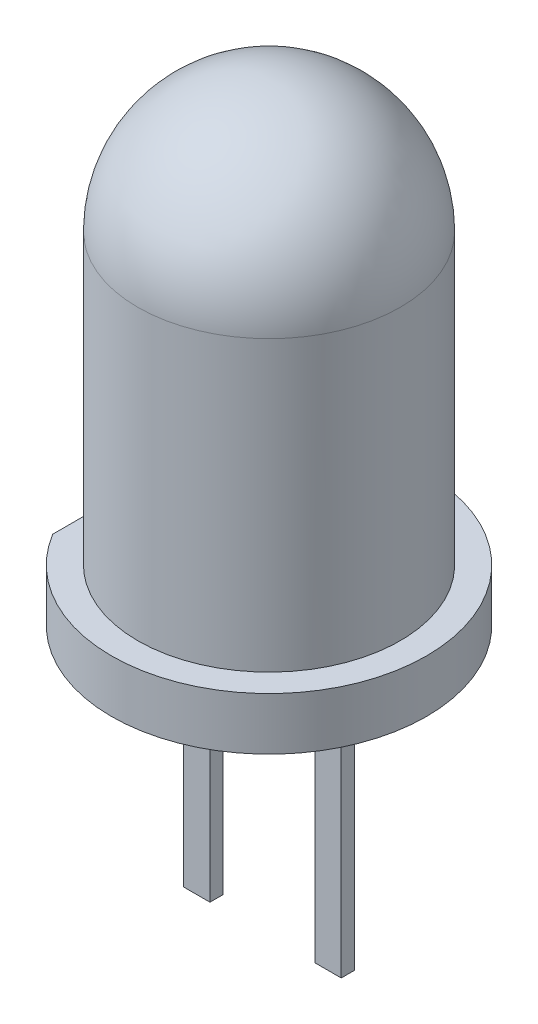
ISO-10303-21;
HEADER;
FILE_DESCRIPTION(('STEP AP214'),'2;1');
FILE_NAME('part.step','',(''),(''),'','','');
FILE_SCHEMA(('AUTOMOTIVE_DESIGN { 1 0 10303 214 1 1 1 1 }'));
ENDSEC;
DATA;
#1=APPLICATION_CONTEXT('core data for automotive mechanical design processes');
#2=APPLICATION_PROTOCOL_DEFINITION('international standard','automotive_design',2000,#1);
#3=PRODUCT_CONTEXT('',#1,'mechanical');
#4=PRODUCT('Part','Part','',(#3));
#5=PRODUCT_RELATED_PRODUCT_CATEGORY('part','',(#4));
#6=PRODUCT_DEFINITION_FORMATION('','',#4);
#7=PRODUCT_DEFINITION_CONTEXT('part definition',#1,'design');
#8=PRODUCT_DEFINITION('design','',#6,#7);
#9=PRODUCT_DEFINITION_SHAPE('','',#8);
#10=(LENGTH_UNIT() NAMED_UNIT(*) SI_UNIT(.MILLI.,.METRE.));
#11=(NAMED_UNIT(*) PLANE_ANGLE_UNIT() SI_UNIT($,.RADIAN.));
#12=(NAMED_UNIT(*) SI_UNIT($,.STERADIAN.) SOLID_ANGLE_UNIT());
#13=UNCERTAINTY_MEASURE_WITH_UNIT(LENGTH_MEASURE(1.E-05),#10,'distance_accuracy_value','');
#14=(GEOMETRIC_REPRESENTATION_CONTEXT(3) GLOBAL_UNCERTAINTY_ASSIGNED_CONTEXT((#13)) GLOBAL_UNIT_ASSIGNED_CONTEXT((#10,
#11,#12)) REPRESENTATION_CONTEXT('',''));
#15=CARTESIAN_POINT('',(0.,0.,0.));
#16=DIRECTION('',(0.,0.,1.));
#17=DIRECTION('',(1.,0.,0.));
#18=AXIS2_PLACEMENT_3D('',#15,#16,#17);
#19=CARTESIAN_POINT('',(0.,-6.5,0.));
#20=DIRECTION('',(0.,1.,0.));
#21=DIRECTION('',(0.,0.,1.));
#22=AXIS2_PLACEMENT_3D('',#19,#20,#21);
#23=PLANE('',#22);
#24=DIRECTION('',(0.,0.,-1.));
#25=VECTOR('',#24,1.);
#26=CARTESIAN_POINT('',(1.,-6.5,0.125));
#27=LINE('',#26,#25);
#28=CARTESIAN_POINT('',(1.,-6.5,0.125));
#29=VERTEX_POINT('',#28);
#30=CARTESIAN_POINT('',(1.,-6.5,-0.125));
#31=VERTEX_POINT('',#30);
#32=EDGE_CURVE('E131',#29,#31,#27,.T.);
#33=ORIENTED_EDGE('',*,*,#32,.F.);
#34=DIRECTION('',(-1.,0.,0.));
#35=VECTOR('',#34,1.);
#36=CARTESIAN_POINT('',(1.,-6.5,0.125));
#37=LINE('',#36,#35);
#38=CARTESIAN_POINT('',(1.5,-6.5,0.125));
#39=VERTEX_POINT('',#38);
#40=EDGE_CURVE('E144',#39,#29,#37,.T.);
#41=ORIENTED_EDGE('',*,*,#40,.F.);
#42=DIRECTION('',(0.,0.,1.));
#43=VECTOR('',#42,1.);
#44=CARTESIAN_POINT('',(1.5,-6.5,0.125));
#45=LINE('',#44,#43);
#46=CARTESIAN_POINT('',(1.5,-6.5,-0.125));
#47=VERTEX_POINT('',#46);
#48=EDGE_CURVE('E153',#47,#39,#45,.T.);
#49=ORIENTED_EDGE('',*,*,#48,.F.);
#50=DIRECTION('',(1.,0.,0.));
#51=VECTOR('',#50,1.);
#52=CARTESIAN_POINT('',(1.,-6.5,-0.125));
#53=LINE('',#52,#51);
#54=EDGE_CURVE('E134',#31,#47,#53,.T.);
#55=ORIENTED_EDGE('',*,*,#54,.F.);
#56=EDGE_LOOP('',(#33,#41,#49,#55));
#57=FACE_BOUND('',#56,.T.);
#58=CARTESIAN_POINT('',(0.,-6.5,0.));
#59=DIRECTION('',(0.,1.,0.));
#60=DIRECTION('',(0.,0.,1.));
#61=AXIS2_PLACEMENT_3D('',#58,#59,#60);
#62=CIRCLE('',#61,3.);
#63=CARTESIAN_POINT('',(-2.56751766388456,-6.5,1.55172582811551));
#64=VERTEX_POINT('',#63);
#65=CARTESIAN_POINT('',(-2.56751766388456,-6.5,-1.55172582811551));
#66=VERTEX_POINT('',#65);
#67=EDGE_CURVE('E41',#64,#66,#62,.T.);
#68=ORIENTED_EDGE('',*,*,#67,.F.);
#69=DIRECTION('',(0.,0.,1.));
#70=VECTOR('',#69,1.);
#71=CARTESIAN_POINT('',(-2.56751766388456,-6.5,1.75));
#72=LINE('',#71,#70);
#73=EDGE_CURVE('E169',#66,#64,#72,.T.);
#74=ORIENTED_EDGE('',*,*,#73,.F.);
#75=EDGE_LOOP('',(#68,#74));
#76=FACE_BOUND('',#75,.T.);
#77=DIRECTION('',(-1.,0.,0.));
#78=VECTOR('',#77,1.);
#79=CARTESIAN_POINT('',(-1.,-6.5,0.125));
#80=LINE('',#79,#78);
#81=CARTESIAN_POINT('',(-1.,-6.5,0.125));
#82=VERTEX_POINT('',#81);
#83=CARTESIAN_POINT('',(-1.5,-6.5,0.125));
#84=VERTEX_POINT('',#83);
#85=EDGE_CURVE('E130',#82,#84,#80,.T.);
#86=ORIENTED_EDGE('',*,*,#85,.F.);
#87=DIRECTION('',(0.,0.,1.));
#88=VECTOR('',#87,1.);
#89=CARTESIAN_POINT('',(-1.,-6.5,0.125));
#90=LINE('',#89,#88);
#91=CARTESIAN_POINT('',(-1.,-6.5,-0.125));
#92=VERTEX_POINT('',#91);
#93=EDGE_CURVE('E127',#92,#82,#90,.T.);
#94=ORIENTED_EDGE('',*,*,#93,.F.);
#95=DIRECTION('',(1.,0.,0.));
#96=VECTOR('',#95,1.);
#97=CARTESIAN_POINT('',(-1.,-6.5,-0.125));
#98=LINE('',#97,#96);
#99=CARTESIAN_POINT('',(-1.5,-6.5,-0.125));
#100=VERTEX_POINT('',#99);
#101=EDGE_CURVE('E53',#100,#92,#98,.T.);
#102=ORIENTED_EDGE('',*,*,#101,.F.);
#103=DIRECTION('',(0.,0.,-1.));
#104=VECTOR('',#103,1.);
#105=CARTESIAN_POINT('',(-1.5,-6.5,0.125));
#106=LINE('',#105,#104);
#107=EDGE_CURVE('E48',#84,#100,#106,.T.);
#108=ORIENTED_EDGE('',*,*,#107,.F.);
#109=EDGE_LOOP('',(#86,#94,#102,#108));
#110=FACE_BOUND('',#109,.T.);
#111=ADVANCED_FACE('F33',(#57,#76,#110),#23,.F.);
#112=CARTESIAN_POINT('',(0.,0.,0.));
#113=DIRECTION('',(0.,1.,0.));
#114=DIRECTION('',(1.,0.,0.));
#115=AXIS2_PLACEMENT_3D('',#112,#113,#114);
#116=SPHERICAL_SURFACE('',#115,2.5);
#117=CARTESIAN_POINT('',(0.,0.,0.));
#118=DIRECTION('',(0.,1.,0.));
#119=DIRECTION('',(0.,0.,1.));
#120=AXIS2_PLACEMENT_3D('',#117,#118,#119);
#121=CIRCLE('',#120,2.5);
#122=CARTESIAN_POINT('',(0.,0.,2.5));
#123=VERTEX_POINT('',#122);
#124=EDGE_CURVE('E177',#123,#123,#121,.T.);
#125=ORIENTED_EDGE('',*,*,#124,.T.);
#126=EDGE_LOOP('',(#125));
#127=FACE_BOUND('',#126,.T.);
#128=ADVANCED_FACE('F35',(#127),#116,.T.);
#129=CARTESIAN_POINT('',(0.,40.48125,0.));
#130=DIRECTION('',(0.,1.,0.));
#131=DIRECTION('',(0.,0.,1.));
#132=AXIS2_PLACEMENT_3D('',#129,#130,#131);
#133=CYLINDRICAL_SURFACE('',#132,3.);
#134=ORIENTED_EDGE('',*,*,#67,.T.);
#135=DIRECTION('',(0.,1.,0.));
#136=VECTOR('',#135,1.);
#137=CARTESIAN_POINT('',(-2.56751766388456,40.48125,-1.55172582811551));
#138=LINE('',#137,#136);
#139=CARTESIAN_POINT('',(-2.56751766388456,-5.5,-1.55172582811551));
#140=VERTEX_POINT('',#139);
#141=EDGE_CURVE('E174',#66,#140,#138,.T.);
#142=ORIENTED_EDGE('',*,*,#141,.T.);
#143=CARTESIAN_POINT('',(0.,-5.5,0.));
#144=DIRECTION('',(0.,1.,0.));
#145=DIRECTION('',(0.,0.,1.));
#146=AXIS2_PLACEMENT_3D('',#143,#144,#145);
#147=CIRCLE('',#146,3.);
#148=CARTESIAN_POINT('',(-2.56751766388456,-5.5,1.55172582811551));
#149=VERTEX_POINT('',#148);
#150=EDGE_CURVE('E183',#149,#140,#147,.T.);
#151=ORIENTED_EDGE('',*,*,#150,.F.);
#152=DIRECTION('',(0.,1.,0.));
#153=VECTOR('',#152,1.);
#154=CARTESIAN_POINT('',(-2.56751766388456,40.48125,1.55172582811551));
#155=LINE('',#154,#153);
#156=EDGE_CURVE('E171',#149,#64,#155,.F.);
#157=ORIENTED_EDGE('',*,*,#156,.T.);
#158=EDGE_LOOP('',(#134,#142,#151,#157));
#159=FACE_BOUND('',#158,.T.);
#160=ADVANCED_FACE('F188',(#159),#133,.T.);
#161=CARTESIAN_POINT('',(2.5,-5.5,0.));
#162=DIRECTION('',(0.,-1.,0.));
#163=DIRECTION('',(0.,0.,-1.));
#164=AXIS2_PLACEMENT_3D('',#161,#162,#163);
#165=PLANE('',#164);
#166=CARTESIAN_POINT('',(0.,-5.5,0.));
#167=DIRECTION('',(0.,1.,0.));
#168=DIRECTION('',(0.,0.,1.));
#169=AXIS2_PLACEMENT_3D('',#166,#167,#168);
#170=CIRCLE('',#169,2.5);
#171=CARTESIAN_POINT('',(0.,-5.5,2.5));
#172=VERTEX_POINT('',#171);
#173=EDGE_CURVE('E180',#172,#172,#170,.T.);
#174=ORIENTED_EDGE('',*,*,#173,.F.);
#175=EDGE_LOOP('',(#174));
#176=FACE_BOUND('',#175,.T.);
#177=ORIENTED_EDGE('',*,*,#150,.T.);
#178=DIRECTION('',(0.,0.,1.));
#179=VECTOR('',#178,1.);
#180=CARTESIAN_POINT('',(-2.56751766388456,-5.5,0.));
#181=LINE('',#180,#179);
#182=EDGE_CURVE('E11',#140,#149,#181,.T.);
#183=ORIENTED_EDGE('',*,*,#182,.T.);
#184=EDGE_LOOP('',(#177,#183));
#185=FACE_BOUND('',#184,.T.);
#186=ADVANCED_FACE('F195',(#176,#185),#165,.F.);
#187=CARTESIAN_POINT('',(0.,40.48125,0.));
#188=DIRECTION('',(0.,1.,0.));
#189=DIRECTION('',(0.,0.,1.));
#190=AXIS2_PLACEMENT_3D('',#187,#188,#189);
#191=CYLINDRICAL_SURFACE('',#190,2.5);
#192=ORIENTED_EDGE('',*,*,#124,.F.);
#193=EDGE_LOOP('',(#192));
#194=FACE_BOUND('',#193,.T.);
#195=ORIENTED_EDGE('',*,*,#173,.T.);
#196=EDGE_LOOP('',(#195));
#197=FACE_BOUND('',#196,.T.);
#198=ADVANCED_FACE('F197',(#194,#197),#191,.T.);
#199=CARTESIAN_POINT('',(-2.56751766388456,-4.5,1.75));
#200=DIRECTION('',(1.,0.,0.));
#201=DIRECTION('',(0.,0.,-1.));
#202=AXIS2_PLACEMENT_3D('',#199,#200,#201);
#203=PLANE('',#202);
#204=ORIENTED_EDGE('',*,*,#73,.T.);
#205=ORIENTED_EDGE('',*,*,#156,.F.);
#206=ORIENTED_EDGE('',*,*,#182,.F.);
#207=ORIENTED_EDGE('',*,*,#141,.F.);
#208=EDGE_LOOP('',(#204,#205,#206,#207));
#209=FACE_BOUND('',#208,.T.);
#210=ADVANCED_FACE('F193',(#209),#203,.F.);
#211=CARTESIAN_POINT('',(1.,-11.5,0.125));
#212=DIRECTION('',(1.,0.,0.));
#213=DIRECTION('',(0.,0.,-1.));
#214=AXIS2_PLACEMENT_3D('',#211,#212,#213);
#215=PLANE('',#214);
#216=ORIENTED_EDGE('',*,*,#32,.T.);
#217=DIRECTION('',(0.,1.,0.));
#218=VECTOR('',#217,1.);
#219=CARTESIAN_POINT('',(1.,-11.5,-0.125));
#220=LINE('',#219,#218);
#221=CARTESIAN_POINT('',(1.,-11.5,-0.125));
#222=VERTEX_POINT('',#221);
#223=EDGE_CURVE('E166',#222,#31,#220,.T.);
#224=ORIENTED_EDGE('',*,*,#223,.F.);
#225=DIRECTION('',(0.,0.,-1.));
#226=VECTOR('',#225,1.);
#227=CARTESIAN_POINT('',(1.,-11.5,0.125));
#228=LINE('',#227,#226);
#229=CARTESIAN_POINT('',(1.,-11.5,0.125));
#230=VERTEX_POINT('',#229);
#231=EDGE_CURVE('E140',#230,#222,#228,.T.);
#232=ORIENTED_EDGE('',*,*,#231,.F.);
#233=DIRECTION('',(0.,1.,0.));
#234=VECTOR('',#233,1.);
#235=CARTESIAN_POINT('',(1.,-11.5,0.125));
#236=LINE('',#235,#234);
#237=EDGE_CURVE('E149',#230,#29,#236,.T.);
#238=ORIENTED_EDGE('',*,*,#237,.T.);
#239=EDGE_LOOP('',(#216,#224,#232,#238));
#240=FACE_BOUND('',#239,.T.);
#241=ADVANCED_FACE('F222',(#240),#215,.F.);
#242=CARTESIAN_POINT('',(1.,-11.5,-0.125));
#243=DIRECTION('',(0.,0.,1.));
#244=DIRECTION('',(1.,0.,0.));
#245=AXIS2_PLACEMENT_3D('',#242,#243,#244);
#246=PLANE('',#245);
#247=ORIENTED_EDGE('',*,*,#54,.T.);
#248=DIRECTION('',(0.,1.,0.));
#249=VECTOR('',#248,1.);
#250=CARTESIAN_POINT('',(1.5,-11.5,-0.125));
#251=LINE('',#250,#249);
#252=CARTESIAN_POINT('',(1.5,-11.5,-0.125));
#253=VERTEX_POINT('',#252);
#254=EDGE_CURVE('E163',#253,#47,#251,.T.);
#255=ORIENTED_EDGE('',*,*,#254,.F.);
#256=DIRECTION('',(1.,0.,0.));
#257=VECTOR('',#256,1.);
#258=CARTESIAN_POINT('',(1.,-11.5,-0.125));
#259=LINE('',#258,#257);
#260=EDGE_CURVE('E143',#222,#253,#259,.T.);
#261=ORIENTED_EDGE('',*,*,#260,.F.);
#262=ORIENTED_EDGE('',*,*,#223,.T.);
#263=EDGE_LOOP('',(#247,#255,#261,#262));
#264=FACE_BOUND('',#263,.T.);
#265=ADVANCED_FACE('F230',(#264),#246,.F.);
#266=CARTESIAN_POINT('',(1.5,-11.5,0.125));
#267=DIRECTION('',(-1.,0.,0.));
#268=DIRECTION('',(0.,0.,1.));
#269=AXIS2_PLACEMENT_3D('',#266,#267,#268);
#270=PLANE('',#269);
#271=ORIENTED_EDGE('',*,*,#48,.T.);
#272=DIRECTION('',(0.,1.,0.));
#273=VECTOR('',#272,1.);
#274=CARTESIAN_POINT('',(1.5,-11.5,0.125));
#275=LINE('',#274,#273);
#276=CARTESIAN_POINT('',(1.5,-11.5,0.125));
#277=VERTEX_POINT('',#276);
#278=EDGE_CURVE('E160',#277,#39,#275,.T.);
#279=ORIENTED_EDGE('',*,*,#278,.F.);
#280=DIRECTION('',(0.,0.,1.));
#281=VECTOR('',#280,1.);
#282=CARTESIAN_POINT('',(1.5,-11.5,0.125));
#283=LINE('',#282,#281);
#284=EDGE_CURVE('E146',#253,#277,#283,.T.);
#285=ORIENTED_EDGE('',*,*,#284,.F.);
#286=ORIENTED_EDGE('',*,*,#254,.T.);
#287=EDGE_LOOP('',(#271,#279,#285,#286));
#288=FACE_BOUND('',#287,.T.);
#289=ADVANCED_FACE('F228',(#288),#270,.F.);
#290=CARTESIAN_POINT('',(1.,-11.5,0.125));
#291=DIRECTION('',(0.,0.,-1.));
#292=DIRECTION('',(-1.,0.,0.));
#293=AXIS2_PLACEMENT_3D('',#290,#291,#292);
#294=PLANE('',#293);
#295=ORIENTED_EDGE('',*,*,#40,.T.);
#296=ORIENTED_EDGE('',*,*,#237,.F.);
#297=DIRECTION('',(-1.,0.,0.));
#298=VECTOR('',#297,1.);
#299=CARTESIAN_POINT('',(1.,-11.5,0.125));
#300=LINE('',#299,#298);
#301=EDGE_CURVE('E148',#277,#230,#300,.T.);
#302=ORIENTED_EDGE('',*,*,#301,.F.);
#303=ORIENTED_EDGE('',*,*,#278,.T.);
#304=EDGE_LOOP('',(#295,#296,#302,#303));
#305=FACE_BOUND('',#304,.T.);
#306=ADVANCED_FACE('F218',(#305),#294,.F.);
#307=CARTESIAN_POINT('',(0.,-11.5,0.));
#308=DIRECTION('',(0.,-1.,0.));
#309=DIRECTION('',(0.,0.,-1.));
#310=AXIS2_PLACEMENT_3D('',#307,#308,#309);
#311=PLANE('',#310);
#312=ORIENTED_EDGE('',*,*,#231,.T.);
#313=ORIENTED_EDGE('',*,*,#260,.T.);
#314=ORIENTED_EDGE('',*,*,#284,.T.);
#315=ORIENTED_EDGE('',*,*,#301,.T.);
#316=EDGE_LOOP('',(#312,#313,#314,#315));
#317=FACE_BOUND('',#316,.T.);
#318=ADVANCED_FACE('F224',(#317),#311,.T.);
#319=CARTESIAN_POINT('',(-1.,-11.5,0.125));
#320=DIRECTION('',(0.,0.,-1.));
#321=DIRECTION('',(-1.,0.,0.));
#322=AXIS2_PLACEMENT_3D('',#319,#320,#321);
#323=PLANE('',#322);
#324=ORIENTED_EDGE('',*,*,#85,.T.);
#325=DIRECTION('',(0.,1.,0.));
#326=VECTOR('',#325,1.);
#327=CARTESIAN_POINT('',(-1.5,-11.5,0.125));
#328=LINE('',#327,#326);
#329=CARTESIAN_POINT('',(-1.5,-11.5,0.125));
#330=VERTEX_POINT('',#329);
#331=EDGE_CURVE('E111',#330,#84,#328,.T.);
#332=ORIENTED_EDGE('',*,*,#331,.F.);
#333=DIRECTION('',(-1.,0.,0.));
#334=VECTOR('',#333,1.);
#335=CARTESIAN_POINT('',(-1.,-11.5,0.125));
#336=LINE('',#335,#334);
#337=CARTESIAN_POINT('',(-1.,-11.5,0.125));
#338=VERTEX_POINT('',#337);
#339=EDGE_CURVE('E118',#338,#330,#336,.T.);
#340=ORIENTED_EDGE('',*,*,#339,.F.);
#341=DIRECTION('',(0.,1.,0.));
#342=VECTOR('',#341,1.);
#343=CARTESIAN_POINT('',(-1.,-11.5,0.125));
#344=LINE('',#343,#342);
#345=EDGE_CURVE('E327',#338,#82,#344,.T.);
#346=ORIENTED_EDGE('',*,*,#345,.T.);
#347=EDGE_LOOP('',(#324,#332,#340,#346));
#348=FACE_BOUND('',#347,.T.);
#349=ADVANCED_FACE('F129',(#348),#323,.F.);
#350=CARTESIAN_POINT('',(-1.5,-11.5,0.125));
#351=DIRECTION('',(1.,0.,0.));
#352=DIRECTION('',(0.,0.,-1.));
#353=AXIS2_PLACEMENT_3D('',#350,#351,#352);
#354=PLANE('',#353);
#355=ORIENTED_EDGE('',*,*,#107,.T.);
#356=DIRECTION('',(0.,1.,0.));
#357=VECTOR('',#356,1.);
#358=CARTESIAN_POINT('',(-1.5,-11.5,-0.125));
#359=LINE('',#358,#357);
#360=CARTESIAN_POINT('',(-1.5,-11.5,-0.125));
#361=VERTEX_POINT('',#360);
#362=EDGE_CURVE('E114',#361,#100,#359,.T.);
#363=ORIENTED_EDGE('',*,*,#362,.F.);
#364=DIRECTION('',(0.,0.,-1.));
#365=VECTOR('',#364,1.);
#366=CARTESIAN_POINT('',(-1.5,-11.5,0.125));
#367=LINE('',#366,#365);
#368=EDGE_CURVE('E107',#330,#361,#367,.T.);
#369=ORIENTED_EDGE('',*,*,#368,.F.);
#370=ORIENTED_EDGE('',*,*,#331,.T.);
#371=EDGE_LOOP('',(#355,#363,#369,#370));
#372=FACE_BOUND('',#371,.T.);
#373=ADVANCED_FACE('F109',(#372),#354,.F.);
#374=CARTESIAN_POINT('',(-1.,-11.5,-0.125));
#375=DIRECTION('',(0.,0.,1.));
#376=DIRECTION('',(1.,0.,0.));
#377=AXIS2_PLACEMENT_3D('',#374,#375,#376);
#378=PLANE('',#377);
#379=ORIENTED_EDGE('',*,*,#101,.T.);
#380=DIRECTION('',(0.,1.,0.));
#381=VECTOR('',#380,1.);
#382=CARTESIAN_POINT('',(-1.,-11.5,-0.125));
#383=LINE('',#382,#381);
#384=CARTESIAN_POINT('',(-1.,-11.5,-0.125));
#385=VERTEX_POINT('',#384);
#386=EDGE_CURVE('E136',#385,#92,#383,.T.);
#387=ORIENTED_EDGE('',*,*,#386,.F.);
#388=DIRECTION('',(1.,0.,0.));
#389=VECTOR('',#388,1.);
#390=CARTESIAN_POINT('',(-1.,-11.5,-0.125));
#391=LINE('',#390,#389);
#392=EDGE_CURVE('E117',#361,#385,#391,.T.);
#393=ORIENTED_EDGE('',*,*,#392,.F.);
#394=ORIENTED_EDGE('',*,*,#362,.T.);
#395=EDGE_LOOP('',(#379,#387,#393,#394));
#396=FACE_BOUND('',#395,.T.);
#397=ADVANCED_FACE('F294',(#396),#378,.F.);
#398=CARTESIAN_POINT('',(-1.,-11.5,0.125));
#399=DIRECTION('',(-1.,0.,0.));
#400=DIRECTION('',(0.,0.,1.));
#401=AXIS2_PLACEMENT_3D('',#398,#399,#400);
#402=PLANE('',#401);
#403=ORIENTED_EDGE('',*,*,#93,.T.);
#404=ORIENTED_EDGE('',*,*,#345,.F.);
#405=DIRECTION('',(0.,0.,1.));
#406=VECTOR('',#405,1.);
#407=CARTESIAN_POINT('',(-1.,-11.5,0.125));
#408=LINE('',#407,#406);
#409=EDGE_CURVE('E123',#385,#338,#408,.T.);
#410=ORIENTED_EDGE('',*,*,#409,.F.);
#411=ORIENTED_EDGE('',*,*,#386,.T.);
#412=EDGE_LOOP('',(#403,#404,#410,#411));
#413=FACE_BOUND('',#412,.T.);
#414=ADVANCED_FACE('F303',(#413),#402,.F.);
#415=CARTESIAN_POINT('',(0.,-11.5,0.));
#416=DIRECTION('',(0.,-1.,0.));
#417=DIRECTION('',(0.,0.,-1.));
#418=AXIS2_PLACEMENT_3D('',#415,#416,#417);
#419=PLANE('',#418);
#420=ORIENTED_EDGE('',*,*,#339,.T.);
#421=ORIENTED_EDGE('',*,*,#368,.T.);
#422=ORIENTED_EDGE('',*,*,#392,.T.);
#423=ORIENTED_EDGE('',*,*,#409,.T.);
#424=EDGE_LOOP('',(#420,#421,#422,#423));
#425=FACE_BOUND('',#424,.T.);
#426=ADVANCED_FACE('F121',(#425),#419,.T.);
#427=CLOSED_SHELL('',(#111,#128,#160,#186,#198,#210,#241,#265,#289,#306,#318,#349,#373,#397,
#414,#426));
#428=MANIFOLD_SOLID_BREP('B2',#427);
#429=ADVANCED_BREP_SHAPE_REPRESENTATION('',(#18,#428),#14);
#430=SHAPE_DEFINITION_REPRESENTATION(#9,#429);
ENDSEC;
END-ISO-10303-21;
